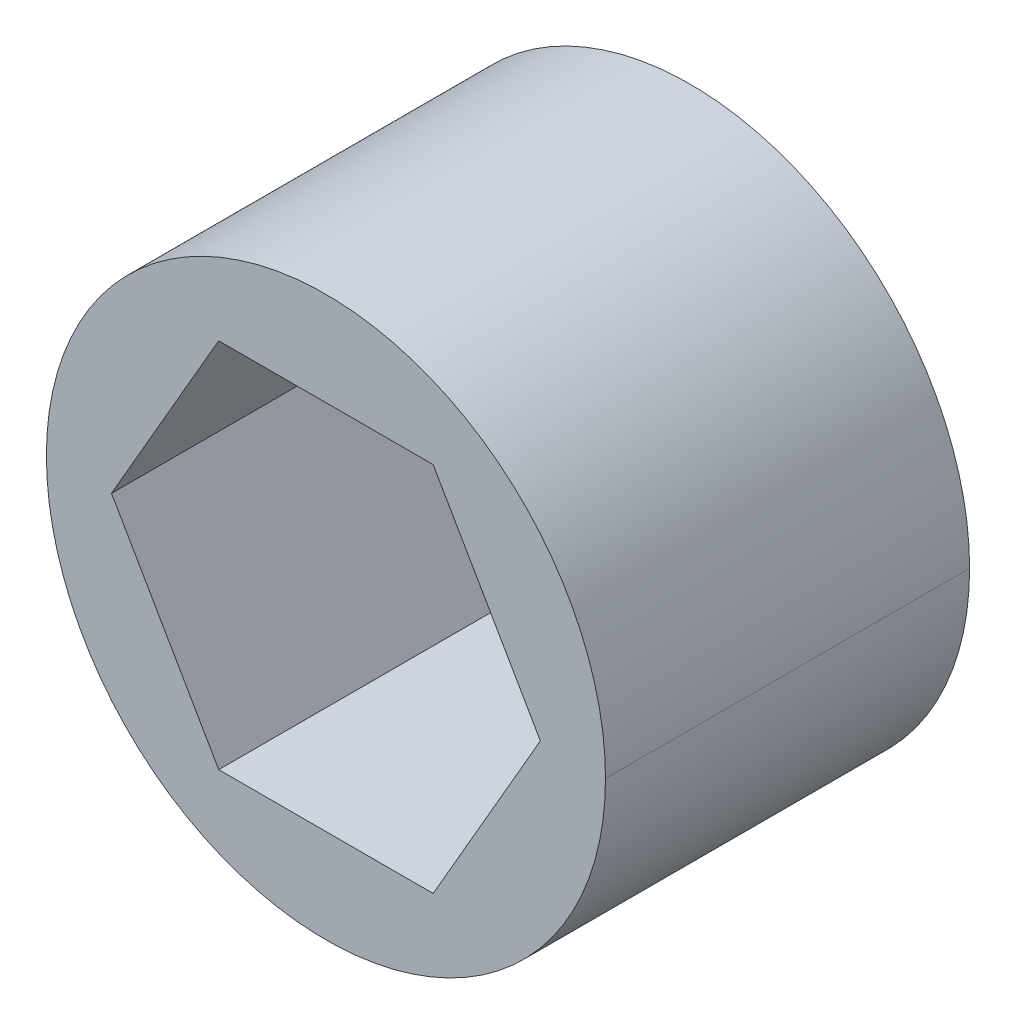
ISO-10303-21;
HEADER;
FILE_DESCRIPTION(('STEP AP214'),'2;1');
FILE_NAME('part.step','',(''),(''),'','','');
FILE_SCHEMA(('AUTOMOTIVE_DESIGN { 1 0 10303 214 1 1 1 1 }'));
ENDSEC;
DATA;
#1=APPLICATION_CONTEXT('core data for automotive mechanical design processes');
#2=APPLICATION_PROTOCOL_DEFINITION('international standard','automotive_design',2000,#1);
#3=PRODUCT_CONTEXT('',#1,'mechanical');
#4=PRODUCT('Part','Part','',(#3));
#5=PRODUCT_RELATED_PRODUCT_CATEGORY('part','',(#4));
#6=PRODUCT_DEFINITION_FORMATION('','',#4);
#7=PRODUCT_DEFINITION_CONTEXT('part definition',#1,'design');
#8=PRODUCT_DEFINITION('design','',#6,#7);
#9=PRODUCT_DEFINITION_SHAPE('','',#8);
#10=(LENGTH_UNIT() NAMED_UNIT(*) SI_UNIT(.MILLI.,.METRE.));
#11=(NAMED_UNIT(*) PLANE_ANGLE_UNIT() SI_UNIT($,.RADIAN.));
#12=(NAMED_UNIT(*) SI_UNIT($,.STERADIAN.) SOLID_ANGLE_UNIT());
#13=UNCERTAINTY_MEASURE_WITH_UNIT(LENGTH_MEASURE(1.E-05),#10,'distance_accuracy_value','');
#14=(GEOMETRIC_REPRESENTATION_CONTEXT(3) GLOBAL_UNCERTAINTY_ASSIGNED_CONTEXT((#13)) GLOBAL_UNIT_ASSIGNED_CONTEXT((#10,
#11,#12)) REPRESENTATION_CONTEXT('',''));
#15=CARTESIAN_POINT('',(0.,0.,0.));
#16=DIRECTION('',(0.,0.,1.));
#17=DIRECTION('',(1.,0.,0.));
#18=AXIS2_PLACEMENT_3D('',#15,#16,#17);
#19=CARTESIAN_POINT('',(-7.47899538708241,0.,6.35));
#20=DIRECTION('',(0.866025403784439,0.5,0.));
#21=DIRECTION('',(0.,0.,-1.));
#22=AXIS2_PLACEMENT_3D('',#19,#20,#21);
#23=PLANE('',#22);
#24=DIRECTION('',(-0.5,0.866025403784439,0.));
#25=VECTOR('',#24,1.);
#26=CARTESIAN_POINT('',(-3.7394976935412,-6.477,6.35));
#27=LINE('',#26,#25);
#28=CARTESIAN_POINT('',(-3.7394976935412,-6.477,6.35));
#29=VERTEX_POINT('',#28);
#30=CARTESIAN_POINT('',(-7.47899538708241,0.,6.35));
#31=VERTEX_POINT('',#30);
#32=EDGE_CURVE('E129',#29,#31,#27,.T.);
#33=ORIENTED_EDGE('',*,*,#32,.F.);
#34=DIRECTION('',(0.,0.,1.));
#35=VECTOR('',#34,1.);
#36=CARTESIAN_POINT('',(-3.73949769354121,-6.477,6.35));
#37=LINE('',#36,#35);
#38=CARTESIAN_POINT('',(-3.7394976935412,-6.477,-6.35));
#39=VERTEX_POINT('',#38);
#40=EDGE_CURVE('E151',#39,#29,#37,.T.);
#41=ORIENTED_EDGE('',*,*,#40,.F.);
#42=DIRECTION('',(-0.5,0.866025403784439,0.));
#43=VECTOR('',#42,1.);
#44=CARTESIAN_POINT('',(-3.73949769354121,-6.477,-6.35));
#45=LINE('',#44,#43);
#46=CARTESIAN_POINT('',(-7.47899538708241,0.,-6.35));
#47=VERTEX_POINT('',#46);
#48=EDGE_CURVE('E146',#39,#47,#45,.T.);
#49=ORIENTED_EDGE('',*,*,#48,.T.);
#50=DIRECTION('',(0.,0.,-1.));
#51=VECTOR('',#50,1.);
#52=CARTESIAN_POINT('',(-7.47899538708241,0.,6.35));
#53=LINE('',#52,#51);
#54=EDGE_CURVE('E11',#31,#47,#53,.T.);
#55=ORIENTED_EDGE('',*,*,#54,.F.);
#56=EDGE_LOOP('',(#33,#41,#49,#55));
#57=FACE_BOUND('',#56,.T.);
#58=ADVANCED_FACE('F16',(#57),#23,.T.);
#59=CARTESIAN_POINT('',(-3.73949769354121,6.477,6.35));
#60=DIRECTION('',(0.866025403784439,-0.5,0.));
#61=DIRECTION('',(0.,0.,-1.));
#62=AXIS2_PLACEMENT_3D('',#59,#60,#61);
#63=PLANE('',#62);
#64=DIRECTION('',(0.5,0.866025403784439,0.));
#65=VECTOR('',#64,1.);
#66=CARTESIAN_POINT('',(-7.47899538708242,0.,6.35));
#67=LINE('',#66,#65);
#68=CARTESIAN_POINT('',(-3.73949769354121,6.477,6.35));
#69=VERTEX_POINT('',#68);
#70=EDGE_CURVE('E111',#31,#69,#67,.T.);
#71=ORIENTED_EDGE('',*,*,#70,.F.);
#72=ORIENTED_EDGE('',*,*,#54,.T.);
#73=DIRECTION('',(0.5,0.866025403784439,0.));
#74=VECTOR('',#73,1.);
#75=CARTESIAN_POINT('',(-7.47899538708241,0.,-6.35));
#76=LINE('',#75,#74);
#77=CARTESIAN_POINT('',(-3.73949769354121,6.477,-6.35));
#78=VERTEX_POINT('',#77);
#79=EDGE_CURVE('E114',#47,#78,#76,.T.);
#80=ORIENTED_EDGE('',*,*,#79,.T.);
#81=DIRECTION('',(0.,0.,-1.));
#82=VECTOR('',#81,1.);
#83=CARTESIAN_POINT('',(-3.73949769354121,6.477,6.35));
#84=LINE('',#83,#82);
#85=EDGE_CURVE('E27',#69,#78,#84,.T.);
#86=ORIENTED_EDGE('',*,*,#85,.F.);
#87=EDGE_LOOP('',(#71,#72,#80,#86));
#88=FACE_BOUND('',#87,.T.);
#89=ADVANCED_FACE('F110',(#88),#63,.T.);
#90=CARTESIAN_POINT('',(3.7394976935412,6.477,6.35));
#91=DIRECTION('',(0.,-1.,0.));
#92=DIRECTION('',(0.,0.,-1.));
#93=AXIS2_PLACEMENT_3D('',#90,#91,#92);
#94=PLANE('',#93);
#95=DIRECTION('',(1.,0.,0.));
#96=VECTOR('',#95,1.);
#97=CARTESIAN_POINT('',(0.,6.477,6.35));
#98=LINE('',#97,#96);
#99=CARTESIAN_POINT('',(3.7394976935412,6.477,6.35));
#100=VERTEX_POINT('',#99);
#101=EDGE_CURVE('E127',#69,#100,#98,.T.);
#102=ORIENTED_EDGE('',*,*,#101,.F.);
#103=ORIENTED_EDGE('',*,*,#85,.T.);
#104=DIRECTION('',(1.,0.,0.));
#105=VECTOR('',#104,1.);
#106=CARTESIAN_POINT('',(0.,6.477,-6.35));
#107=LINE('',#106,#105);
#108=CARTESIAN_POINT('',(3.7394976935412,6.477,-6.35));
#109=VERTEX_POINT('',#108);
#110=EDGE_CURVE('E149',#78,#109,#107,.T.);
#111=ORIENTED_EDGE('',*,*,#110,.T.);
#112=DIRECTION('',(0.,0.,-1.));
#113=VECTOR('',#112,1.);
#114=CARTESIAN_POINT('',(3.7394976935412,6.477,6.35));
#115=LINE('',#114,#113);
#116=EDGE_CURVE('E120',#100,#109,#115,.T.);
#117=ORIENTED_EDGE('',*,*,#116,.F.);
#118=EDGE_LOOP('',(#102,#103,#111,#117));
#119=FACE_BOUND('',#118,.T.);
#120=ADVANCED_FACE('F133',(#119),#94,.T.);
#121=CARTESIAN_POINT('',(7.47899538708241,0.,6.35));
#122=DIRECTION('',(-0.866025403784439,-0.5,0.));
#123=DIRECTION('',(-0.5,0.866025403784439,0.));
#124=AXIS2_PLACEMENT_3D('',#121,#122,#123);
#125=PLANE('',#124);
#126=DIRECTION('',(0.5,-0.866025403784439,0.));
#127=VECTOR('',#126,1.);
#128=CARTESIAN_POINT('',(3.7394976935412,6.477,6.35));
#129=LINE('',#128,#127);
#130=CARTESIAN_POINT('',(7.47899538708242,0.,6.35));
#131=VERTEX_POINT('',#130);
#132=EDGE_CURVE('E136',#100,#131,#129,.T.);
#133=ORIENTED_EDGE('',*,*,#132,.F.);
#134=ORIENTED_EDGE('',*,*,#116,.T.);
#135=DIRECTION('',(0.5,-0.866025403784439,0.));
#136=VECTOR('',#135,1.);
#137=CARTESIAN_POINT('',(3.7394976935412,6.477,-6.35));
#138=LINE('',#137,#136);
#139=CARTESIAN_POINT('',(7.47899538708241,0.,-6.35));
#140=VERTEX_POINT('',#139);
#141=EDGE_CURVE('E162',#109,#140,#138,.T.);
#142=ORIENTED_EDGE('',*,*,#141,.T.);
#143=DIRECTION('',(0.,0.,-1.));
#144=VECTOR('',#143,1.);
#145=CARTESIAN_POINT('',(7.47899538708242,0.,6.35));
#146=LINE('',#145,#144);
#147=EDGE_CURVE('E79',#131,#140,#146,.T.);
#148=ORIENTED_EDGE('',*,*,#147,.F.);
#149=EDGE_LOOP('',(#133,#134,#142,#148));
#150=FACE_BOUND('',#149,.T.);
#151=ADVANCED_FACE('F176',(#150),#125,.T.);
#152=CARTESIAN_POINT('',(3.7394976935412,-6.477,6.35));
#153=DIRECTION('',(-0.866025403784439,0.5,0.));
#154=DIRECTION('',(0.,0.,1.));
#155=AXIS2_PLACEMENT_3D('',#152,#153,#154);
#156=PLANE('',#155);
#157=DIRECTION('',(-0.5,-0.866025403784439,0.));
#158=VECTOR('',#157,1.);
#159=CARTESIAN_POINT('',(7.47899538708241,0.,6.35));
#160=LINE('',#159,#158);
#161=CARTESIAN_POINT('',(3.73949769354121,-6.477,6.35));
#162=VERTEX_POINT('',#161);
#163=EDGE_CURVE('E143',#131,#162,#160,.T.);
#164=ORIENTED_EDGE('',*,*,#163,.F.);
#165=ORIENTED_EDGE('',*,*,#147,.T.);
#166=DIRECTION('',(-0.5,-0.866025403784439,0.));
#167=VECTOR('',#166,1.);
#168=CARTESIAN_POINT('',(7.47899538708241,0.,-6.35));
#169=LINE('',#168,#167);
#170=CARTESIAN_POINT('',(3.73949769354121,-6.477,-6.35));
#171=VERTEX_POINT('',#170);
#172=EDGE_CURVE('E159',#140,#171,#169,.T.);
#173=ORIENTED_EDGE('',*,*,#172,.T.);
#174=DIRECTION('',(0.,0.,-1.));
#175=VECTOR('',#174,1.);
#176=CARTESIAN_POINT('',(3.7394976935412,-6.477,6.35));
#177=LINE('',#176,#175);
#178=EDGE_CURVE('E131',#162,#171,#177,.T.);
#179=ORIENTED_EDGE('',*,*,#178,.F.);
#180=EDGE_LOOP('',(#164,#165,#173,#179));
#181=FACE_BOUND('',#180,.T.);
#182=ADVANCED_FACE('F273',(#181),#156,.T.);
#183=CARTESIAN_POINT('',(-3.7394976935412,-6.477,6.35));
#184=DIRECTION('',(0.,1.,0.));
#185=DIRECTION('',(1.,0.,0.));
#186=AXIS2_PLACEMENT_3D('',#183,#184,#185);
#187=PLANE('',#186);
#188=DIRECTION('',(-1.,0.,0.));
#189=VECTOR('',#188,1.);
#190=CARTESIAN_POINT('',(0.,-6.477,6.35));
#191=LINE('',#190,#189);
#192=EDGE_CURVE('E207',#162,#29,#191,.T.);
#193=ORIENTED_EDGE('',*,*,#192,.F.);
#194=ORIENTED_EDGE('',*,*,#178,.T.);
#195=DIRECTION('',(-1.,0.,0.));
#196=VECTOR('',#195,1.);
#197=CARTESIAN_POINT('',(0.,-6.477,-6.35));
#198=LINE('',#197,#196);
#199=EDGE_CURVE('E20',#171,#39,#198,.T.);
#200=ORIENTED_EDGE('',*,*,#199,.T.);
#201=ORIENTED_EDGE('',*,*,#40,.T.);
#202=EDGE_LOOP('',(#193,#194,#200,#201));
#203=FACE_BOUND('',#202,.T.);
#204=ADVANCED_FACE('F265',(#203),#187,.T.);
#205=CARTESIAN_POINT('',(0.,0.,6.35));
#206=DIRECTION('',(0.,0.,1.));
#207=DIRECTION('',(1.,0.,0.));
#208=AXIS2_PLACEMENT_3D('',#205,#206,#207);
#209=PLANE('',#208);
#210=ORIENTED_EDGE('',*,*,#101,.T.);
#211=ORIENTED_EDGE('',*,*,#132,.T.);
#212=ORIENTED_EDGE('',*,*,#163,.T.);
#213=ORIENTED_EDGE('',*,*,#192,.T.);
#214=ORIENTED_EDGE('',*,*,#32,.T.);
#215=ORIENTED_EDGE('',*,*,#70,.T.);
#216=EDGE_LOOP('',(#210,#211,#212,#213,#214,#215));
#217=FACE_BOUND('',#216,.T.);
#218=CARTESIAN_POINT('',(0.,0.,6.35));
#219=DIRECTION('',(0.,0.,-1.));
#220=DIRECTION('',(-1.,0.,0.));
#221=AXIS2_PLACEMENT_3D('',#218,#219,#220);
#222=CIRCLE('',#221,9.75);
#223=CARTESIAN_POINT('',(-9.75,0.,6.35));
#224=VERTEX_POINT('',#223);
#225=CARTESIAN_POINT('',(9.75,0.,6.35));
#226=VERTEX_POINT('',#225);
#227=EDGE_CURVE('E154',#224,#226,#222,.T.);
#228=ORIENTED_EDGE('',*,*,#227,.F.);
#229=CARTESIAN_POINT('',(0.,0.,6.35));
#230=DIRECTION('',(0.,0.,-1.));
#231=DIRECTION('',(-1.,0.,0.));
#232=AXIS2_PLACEMENT_3D('',#229,#230,#231);
#233=CIRCLE('',#232,9.75);
#234=EDGE_CURVE('E169',#226,#224,#233,.T.);
#235=ORIENTED_EDGE('',*,*,#234,.F.);
#236=EDGE_LOOP('',(#228,#235));
#237=FACE_BOUND('',#236,.T.);
#238=ADVANCED_FACE('F124',(#217,#237),#209,.T.);
#239=CARTESIAN_POINT('',(0.,0.,-6.35));
#240=DIRECTION('',(0.,0.,1.));
#241=DIRECTION('',(1.,0.,0.));
#242=AXIS2_PLACEMENT_3D('',#239,#240,#241);
#243=PLANE('',#242);
#244=ORIENTED_EDGE('',*,*,#172,.F.);
#245=ORIENTED_EDGE('',*,*,#141,.F.);
#246=ORIENTED_EDGE('',*,*,#110,.F.);
#247=ORIENTED_EDGE('',*,*,#79,.F.);
#248=ORIENTED_EDGE('',*,*,#48,.F.);
#249=ORIENTED_EDGE('',*,*,#199,.F.);
#250=EDGE_LOOP('',(#244,#245,#246,#247,#248,#249));
#251=FACE_BOUND('',#250,.T.);
#252=CARTESIAN_POINT('',(0.,0.,-6.35));
#253=DIRECTION('',(0.,0.,1.));
#254=DIRECTION('',(-1.,0.,0.));
#255=AXIS2_PLACEMENT_3D('',#252,#253,#254);
#256=CIRCLE('',#255,9.75);
#257=CARTESIAN_POINT('',(-9.75,0.,-6.35));
#258=VERTEX_POINT('',#257);
#259=CARTESIAN_POINT('',(9.75,0.,-6.35));
#260=VERTEX_POINT('',#259);
#261=EDGE_CURVE('E94',#258,#260,#256,.T.);
#262=ORIENTED_EDGE('',*,*,#261,.F.);
#263=CARTESIAN_POINT('',(0.,0.,-6.35));
#264=DIRECTION('',(0.,0.,1.));
#265=DIRECTION('',(-1.,0.,0.));
#266=AXIS2_PLACEMENT_3D('',#263,#264,#265);
#267=CIRCLE('',#266,9.75);
#268=EDGE_CURVE('E163',#260,#258,#267,.T.);
#269=ORIENTED_EDGE('',*,*,#268,.F.);
#270=EDGE_LOOP('',(#262,#269));
#271=FACE_BOUND('',#270,.T.);
#272=ADVANCED_FACE('F181',(#251,#271),#243,.F.);
#273=CARTESIAN_POINT('',(0.,0.,6.35));
#274=DIRECTION('',(0.,0.,-1.));
#275=DIRECTION('',(-1.,0.,0.));
#276=AXIS2_PLACEMENT_3D('',#273,#274,#275);
#277=CYLINDRICAL_SURFACE('',#276,9.75);
#278=DIRECTION('',(0.,0.,-1.));
#279=VECTOR('',#278,1.);
#280=CARTESIAN_POINT('',(9.75,0.,6.35));
#281=LINE('',#280,#279);
#282=EDGE_CURVE('E158',#226,#260,#281,.T.);
#283=ORIENTED_EDGE('',*,*,#282,.F.);
#284=ORIENTED_EDGE('',*,*,#234,.T.);
#285=DIRECTION('',(0.,0.,-1.));
#286=VECTOR('',#285,1.);
#287=CARTESIAN_POINT('',(-9.75,0.,6.35));
#288=LINE('',#287,#286);
#289=EDGE_CURVE('E167',#224,#258,#288,.T.);
#290=ORIENTED_EDGE('',*,*,#289,.T.);
#291=ORIENTED_EDGE('',*,*,#261,.T.);
#292=EDGE_LOOP('',(#283,#284,#290,#291));
#293=FACE_BOUND('',#292,.T.);
#294=ADVANCED_FACE('F314',(#293),#277,.T.);
#295=CARTESIAN_POINT('',(0.,0.,6.35));
#296=DIRECTION('',(0.,0.,-1.));
#297=DIRECTION('',(-1.,0.,0.));
#298=AXIS2_PLACEMENT_3D('',#295,#296,#297);
#299=CYLINDRICAL_SURFACE('',#298,9.75);
#300=ORIENTED_EDGE('',*,*,#227,.T.);
#301=ORIENTED_EDGE('',*,*,#282,.T.);
#302=ORIENTED_EDGE('',*,*,#268,.T.);
#303=ORIENTED_EDGE('',*,*,#289,.F.);
#304=EDGE_LOOP('',(#300,#301,#302,#303));
#305=FACE_BOUND('',#304,.T.);
#306=ADVANCED_FACE('F18',(#305),#299,.T.);
#307=CLOSED_SHELL('',(#58,#89,#120,#151,#182,#204,#238,#272,#294,#306));
#308=MANIFOLD_SOLID_BREP('B1',#307);
#309=ADVANCED_BREP_SHAPE_REPRESENTATION('',(#18,#308),#14);
#310=SHAPE_DEFINITION_REPRESENTATION(#9,#309);
ENDSEC;
END-ISO-10303-21;
